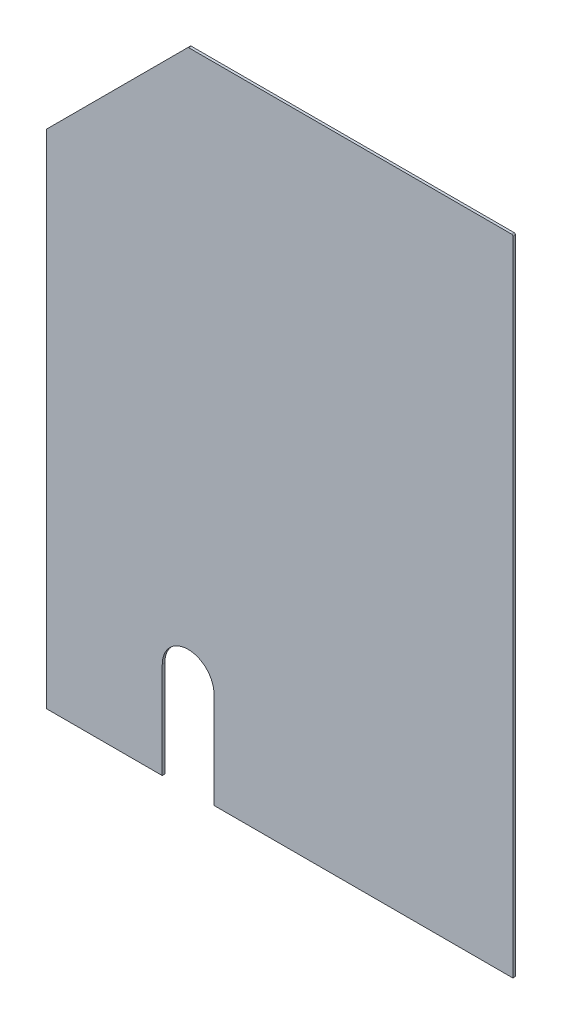
ISO-10303-21;
HEADER;
FILE_DESCRIPTION(('STEP AP214'),'2;1');
FILE_NAME('part.step','',(''),(''),'','','');
FILE_SCHEMA(('AUTOMOTIVE_DESIGN { 1 0 10303 214 1 1 1 1 }'));
ENDSEC;
DATA;
#1=APPLICATION_CONTEXT('core data for automotive mechanical design processes');
#2=APPLICATION_PROTOCOL_DEFINITION('international standard','automotive_design',2000,#1);
#3=PRODUCT_CONTEXT('',#1,'mechanical');
#4=PRODUCT('Part','Part','',(#3));
#5=PRODUCT_RELATED_PRODUCT_CATEGORY('part','',(#4));
#6=PRODUCT_DEFINITION_FORMATION('','',#4);
#7=PRODUCT_DEFINITION_CONTEXT('part definition',#1,'design');
#8=PRODUCT_DEFINITION('design','',#6,#7);
#9=PRODUCT_DEFINITION_SHAPE('','',#8);
#10=(LENGTH_UNIT() NAMED_UNIT(*) SI_UNIT(.MILLI.,.METRE.));
#11=(NAMED_UNIT(*) PLANE_ANGLE_UNIT() SI_UNIT($,.RADIAN.));
#12=(NAMED_UNIT(*) SI_UNIT($,.STERADIAN.) SOLID_ANGLE_UNIT());
#13=UNCERTAINTY_MEASURE_WITH_UNIT(LENGTH_MEASURE(1.E-05),#10,'distance_accuracy_value','');
#14=(GEOMETRIC_REPRESENTATION_CONTEXT(3) GLOBAL_UNCERTAINTY_ASSIGNED_CONTEXT((#13)) GLOBAL_UNIT_ASSIGNED_CONTEXT((#10,
#11,#12)) REPRESENTATION_CONTEXT('',''));
#15=CARTESIAN_POINT('',(0.,0.,0.));
#16=DIRECTION('',(0.,0.,1.));
#17=DIRECTION('',(1.,0.,0.));
#18=AXIS2_PLACEMENT_3D('',#15,#16,#17);
#19=CARTESIAN_POINT('',(-269.326706029105,290.501117880956,-1.5));
#20=DIRECTION('',(0.,0.,1.));
#21=DIRECTION('',(1.,0.,0.));
#22=AXIS2_PLACEMENT_3D('',#19,#20,#21);
#23=CYLINDRICAL_SURFACE('',#22,0.750000000000028);
#24=CARTESIAN_POINT('',(-269.326706029105,290.501117880956,0.));
#25=DIRECTION('',(0.,0.,1.));
#26=DIRECTION('',(1.,0.,0.));
#27=AXIS2_PLACEMENT_3D('',#24,#25,#26);
#28=CIRCLE('',#27,0.750000000000028);
#29=CARTESIAN_POINT('',(-269.857036114995,291.031447966846,0.));
#30=VERTEX_POINT('',#29);
#31=CARTESIAN_POINT('',(-270.076706029105,290.501117880956,0.));
#32=VERTEX_POINT('',#31);
#33=EDGE_CURVE('E159',#30,#32,#28,.T.);
#34=ORIENTED_EDGE('',*,*,#33,.F.);
#35=DIRECTION('',(0.,0.,1.));
#36=VECTOR('',#35,1.);
#37=CARTESIAN_POINT('',(-269.857036114995,291.031447966846,-1.5));
#38=LINE('',#37,#36);
#39=CARTESIAN_POINT('',(-269.857036114995,291.031447966846,-1.5));
#40=VERTEX_POINT('',#39);
#41=EDGE_CURVE('E11',#40,#30,#38,.T.);
#42=ORIENTED_EDGE('',*,*,#41,.F.);
#43=CARTESIAN_POINT('',(-269.326706029105,290.501117880956,-1.5));
#44=DIRECTION('',(0.,0.,1.));
#45=DIRECTION('',(1.,0.,0.));
#46=AXIS2_PLACEMENT_3D('',#43,#44,#45);
#47=CIRCLE('',#46,0.750000000000028);
#48=CARTESIAN_POINT('',(-270.076706029105,290.501117880956,-1.5));
#49=VERTEX_POINT('',#48);
#50=EDGE_CURVE('E191',#40,#49,#47,.T.);
#51=ORIENTED_EDGE('',*,*,#50,.T.);
#52=DIRECTION('',(0.,0.,1.));
#53=VECTOR('',#52,1.);
#54=CARTESIAN_POINT('',(-270.076706029105,290.501117880956,-1.5));
#55=LINE('',#54,#53);
#56=EDGE_CURVE('E41',#49,#32,#55,.T.);
#57=ORIENTED_EDGE('',*,*,#56,.T.);
#58=EDGE_LOOP('',(#34,#42,#51,#57));
#59=FACE_BOUND('',#58,.T.);
#60=ADVANCED_FACE('F38',(#59),#23,.T.);
#61=CARTESIAN_POINT('',(-188.296375943214,372.592108138625,-1.5));
#62=DIRECTION('',(-0.707106781186546,0.707106781186549,0.));
#63=DIRECTION('',(-0.707106781186549,-0.707106781186546,0.));
#64=AXIS2_PLACEMENT_3D('',#61,#62,#63);
#65=PLANE('',#64);
#66=DIRECTION('',(-0.707106781186549,-0.707106781186546,0.));
#67=VECTOR('',#66,1.);
#68=CARTESIAN_POINT('',(-188.296375943214,372.592108138625,0.));
#69=LINE('',#68,#67);
#70=CARTESIAN_POINT('',(-188.296375943214,372.592108138625,0.));
#71=VERTEX_POINT('',#70);
#72=EDGE_CURVE('E189',#71,#30,#69,.T.);
#73=ORIENTED_EDGE('',*,*,#72,.F.);
#74=DIRECTION('',(0.,0.,1.));
#75=VECTOR('',#74,1.);
#76=CARTESIAN_POINT('',(-188.296375943214,372.592108138625,-1.5));
#77=LINE('',#76,#75);
#78=CARTESIAN_POINT('',(-188.296375943214,372.592108138625,-1.5));
#79=VERTEX_POINT('',#78);
#80=EDGE_CURVE('E47',#79,#71,#77,.T.);
#81=ORIENTED_EDGE('',*,*,#80,.F.);
#82=DIRECTION('',(-0.707106781186549,-0.707106781186546,0.));
#83=VECTOR('',#82,1.);
#84=CARTESIAN_POINT('',(-188.296375943214,372.592108138625,-1.5));
#85=LINE('',#84,#83);
#86=EDGE_CURVE('E149',#79,#40,#85,.T.);
#87=ORIENTED_EDGE('',*,*,#86,.T.);
#88=ORIENTED_EDGE('',*,*,#41,.T.);
#89=EDGE_LOOP('',(#73,#81,#87,#88));
#90=FACE_BOUND('',#89,.T.);
#91=ADVANCED_FACE('F211',(#90),#65,.T.);
#92=CARTESIAN_POINT('',(-187.766045857325,372.061778052735,-1.5));
#93=DIRECTION('',(0.,0.,1.));
#94=DIRECTION('',(1.,0.,0.));
#95=AXIS2_PLACEMENT_3D('',#92,#93,#94);
#96=CYLINDRICAL_SURFACE('',#95,0.749999999999962);
#97=CARTESIAN_POINT('',(-187.766045857325,372.061778052735,0.));
#98=DIRECTION('',(0.,0.,1.));
#99=DIRECTION('',(1.,0.,0.));
#100=AXIS2_PLACEMENT_3D('',#97,#98,#99);
#101=CIRCLE('',#100,0.749999999999962);
#102=CARTESIAN_POINT('',(-187.766045857325,372.811778052735,0.));
#103=VERTEX_POINT('',#102);
#104=EDGE_CURVE('E136',#103,#71,#101,.T.);
#105=ORIENTED_EDGE('',*,*,#104,.F.);
#106=DIRECTION('',(0.,0.,1.));
#107=VECTOR('',#106,1.);
#108=CARTESIAN_POINT('',(-187.766045857325,372.811778052735,-1.5));
#109=LINE('',#108,#107);
#110=CARTESIAN_POINT('',(-187.766045857325,372.811778052735,-1.5));
#111=VERTEX_POINT('',#110);
#112=EDGE_CURVE('E131',#111,#103,#109,.T.);
#113=ORIENTED_EDGE('',*,*,#112,.F.);
#114=CARTESIAN_POINT('',(-187.766045857325,372.061778052735,-1.5));
#115=DIRECTION('',(0.,0.,1.));
#116=DIRECTION('',(1.,0.,0.));
#117=AXIS2_PLACEMENT_3D('',#114,#115,#116);
#118=CIRCLE('',#117,0.749999999999962);
#119=EDGE_CURVE('E134',#111,#79,#118,.T.);
#120=ORIENTED_EDGE('',*,*,#119,.T.);
#121=ORIENTED_EDGE('',*,*,#80,.T.);
#122=EDGE_LOOP('',(#105,#113,#120,#121));
#123=FACE_BOUND('',#122,.T.);
#124=ADVANCED_FACE('F133',(#123),#96,.T.);
#125=CARTESIAN_POINT('',(-0.750000000000028,372.811778052735,-1.5));
#126=DIRECTION('',(0.,1.,0.));
#127=DIRECTION('',(0.,0.,1.));
#128=AXIS2_PLACEMENT_3D('',#125,#126,#127);
#129=PLANE('',#128);
#130=DIRECTION('',(-1.,0.,0.));
#131=VECTOR('',#130,1.);
#132=CARTESIAN_POINT('',(-0.750000000000028,372.811778052735,0.));
#133=LINE('',#132,#131);
#134=CARTESIAN_POINT('',(-0.750000000000028,372.811778052735,0.));
#135=VERTEX_POINT('',#134);
#136=EDGE_CURVE('E186',#135,#103,#133,.T.);
#137=ORIENTED_EDGE('',*,*,#136,.F.);
#138=DIRECTION('',(0.,0.,1.));
#139=VECTOR('',#138,1.);
#140=CARTESIAN_POINT('',(-0.750000000000028,372.811778052735,-1.5));
#141=LINE('',#140,#139);
#142=CARTESIAN_POINT('',(-0.750000000000028,372.811778052735,-1.5));
#143=VERTEX_POINT('',#142);
#144=EDGE_CURVE('E141',#143,#135,#141,.T.);
#145=ORIENTED_EDGE('',*,*,#144,.F.);
#146=DIRECTION('',(-1.,0.,0.));
#147=VECTOR('',#146,1.);
#148=CARTESIAN_POINT('',(-0.750000000000028,372.811778052735,-1.5));
#149=LINE('',#148,#147);
#150=EDGE_CURVE('E147',#143,#111,#149,.T.);
#151=ORIENTED_EDGE('',*,*,#150,.T.);
#152=ORIENTED_EDGE('',*,*,#112,.T.);
#153=EDGE_LOOP('',(#137,#145,#151,#152));
#154=FACE_BOUND('',#153,.T.);
#155=ADVANCED_FACE('F151',(#154),#129,.T.);
#156=CARTESIAN_POINT('',(-0.750000000000028,372.061778052735,-1.5));
#157=DIRECTION('',(0.,0.,1.));
#158=DIRECTION('',(1.,0.,0.));
#159=AXIS2_PLACEMENT_3D('',#156,#157,#158);
#160=CYLINDRICAL_SURFACE('',#159,0.749999999999973);
#161=CARTESIAN_POINT('',(-0.750000000000028,372.061778052735,0.));
#162=DIRECTION('',(0.,0.,1.));
#163=DIRECTION('',(1.,0.,0.));
#164=AXIS2_PLACEMENT_3D('',#161,#162,#163);
#165=CIRCLE('',#164,0.749999999999973);
#166=CARTESIAN_POINT('',(0.,372.061778052735,0.));
#167=VERTEX_POINT('',#166);
#168=EDGE_CURVE('E183',#167,#135,#165,.T.);
#169=ORIENTED_EDGE('',*,*,#168,.F.);
#170=DIRECTION('',(0.,0.,1.));
#171=VECTOR('',#170,1.);
#172=CARTESIAN_POINT('',(0.,372.061778052735,-1.5));
#173=LINE('',#172,#171);
#174=CARTESIAN_POINT('',(0.,372.061778052735,-1.5));
#175=VERTEX_POINT('',#174);
#176=EDGE_CURVE('E195',#175,#167,#173,.T.);
#177=ORIENTED_EDGE('',*,*,#176,.F.);
#178=CARTESIAN_POINT('',(-0.750000000000028,372.061778052735,-1.5));
#179=DIRECTION('',(0.,0.,1.));
#180=DIRECTION('',(1.,0.,0.));
#181=AXIS2_PLACEMENT_3D('',#178,#179,#180);
#182=CIRCLE('',#181,0.749999999999973);
#183=EDGE_CURVE('E152',#175,#143,#182,.T.);
#184=ORIENTED_EDGE('',*,*,#183,.T.);
#185=ORIENTED_EDGE('',*,*,#144,.T.);
#186=EDGE_LOOP('',(#169,#177,#184,#185));
#187=FACE_BOUND('',#186,.T.);
#188=ADVANCED_FACE('F224',(#187),#160,.T.);
#189=CARTESIAN_POINT('',(0.,0.,-1.5));
#190=DIRECTION('',(1.,0.,0.));
#191=DIRECTION('',(0.,1.,0.));
#192=AXIS2_PLACEMENT_3D('',#189,#190,#191);
#193=PLANE('',#192);
#194=DIRECTION('',(0.,1.,0.));
#195=VECTOR('',#194,1.);
#196=CARTESIAN_POINT('',(0.,0.,0.));
#197=LINE('',#196,#195);
#198=CARTESIAN_POINT('',(0.,0.,0.));
#199=VERTEX_POINT('',#198);
#200=EDGE_CURVE('E180',#199,#167,#197,.T.);
#201=ORIENTED_EDGE('',*,*,#200,.F.);
#202=DIRECTION('',(0.,0.,1.));
#203=VECTOR('',#202,1.);
#204=CARTESIAN_POINT('',(0.,0.,-1.5));
#205=LINE('',#204,#203);
#206=CARTESIAN_POINT('',(0.,0.,-1.5));
#207=VERTEX_POINT('',#206);
#208=EDGE_CURVE('E197',#207,#199,#205,.T.);
#209=ORIENTED_EDGE('',*,*,#208,.F.);
#210=DIRECTION('',(0.,1.,0.));
#211=VECTOR('',#210,1.);
#212=CARTESIAN_POINT('',(0.,0.,-1.5));
#213=LINE('',#212,#211);
#214=EDGE_CURVE('E154',#207,#175,#213,.T.);
#215=ORIENTED_EDGE('',*,*,#214,.T.);
#216=ORIENTED_EDGE('',*,*,#176,.T.);
#217=EDGE_LOOP('',(#201,#209,#215,#216));
#218=FACE_BOUND('',#217,.T.);
#219=ADVANCED_FACE('F227',(#218),#193,.T.);
#220=CARTESIAN_POINT('',(-173.076706029105,0.,-1.5));
#221=DIRECTION('',(0.,-1.,0.));
#222=DIRECTION('',(1.,0.,0.));
#223=AXIS2_PLACEMENT_3D('',#220,#221,#222);
#224=PLANE('',#223);
#225=DIRECTION('',(1.,0.,0.));
#226=VECTOR('',#225,1.);
#227=CARTESIAN_POINT('',(-173.076706029105,0.,0.));
#228=LINE('',#227,#226);
#229=CARTESIAN_POINT('',(-173.076706029105,0.,0.));
#230=VERTEX_POINT('',#229);
#231=EDGE_CURVE('E177',#230,#199,#228,.T.);
#232=ORIENTED_EDGE('',*,*,#231,.F.);
#233=DIRECTION('',(0.,0.,1.));
#234=VECTOR('',#233,1.);
#235=CARTESIAN_POINT('',(-173.076706029105,0.,-1.5));
#236=LINE('',#235,#234);
#237=CARTESIAN_POINT('',(-173.076706029105,0.,-1.5));
#238=VERTEX_POINT('',#237);
#239=EDGE_CURVE('E199',#238,#230,#236,.T.);
#240=ORIENTED_EDGE('',*,*,#239,.F.);
#241=DIRECTION('',(1.,0.,0.));
#242=VECTOR('',#241,1.);
#243=CARTESIAN_POINT('',(-173.076706029105,0.,-1.5));
#244=LINE('',#243,#242);
#245=EDGE_CURVE('E381',#238,#207,#244,.T.);
#246=ORIENTED_EDGE('',*,*,#245,.T.);
#247=ORIENTED_EDGE('',*,*,#208,.T.);
#248=EDGE_LOOP('',(#232,#240,#246,#247));
#249=FACE_BOUND('',#248,.T.);
#250=ADVANCED_FACE('F231',(#249),#224,.T.);
#251=CARTESIAN_POINT('',(-173.076706029105,55.8117780527354,-1.5));
#252=DIRECTION('',(-1.,0.,0.));
#253=DIRECTION('',(0.,0.,1.));
#254=AXIS2_PLACEMENT_3D('',#251,#252,#253);
#255=PLANE('',#254);
#256=DIRECTION('',(0.,-1.,0.));
#257=VECTOR('',#256,1.);
#258=CARTESIAN_POINT('',(-173.076706029105,55.8117780527354,0.));
#259=LINE('',#258,#257);
#260=CARTESIAN_POINT('',(-173.076706029105,55.8117780527354,0.));
#261=VERTEX_POINT('',#260);
#262=EDGE_CURVE('E174',#261,#230,#259,.T.);
#263=ORIENTED_EDGE('',*,*,#262,.F.);
#264=DIRECTION('',(0.,0.,1.));
#265=VECTOR('',#264,1.);
#266=CARTESIAN_POINT('',(-173.076706029105,55.8117780527354,-1.5));
#267=LINE('',#266,#265);
#268=CARTESIAN_POINT('',(-173.076706029105,55.8117780527354,-1.5));
#269=VERTEX_POINT('',#268);
#270=EDGE_CURVE('E201',#269,#261,#267,.T.);
#271=ORIENTED_EDGE('',*,*,#270,.F.);
#272=DIRECTION('',(0.,-1.,0.));
#273=VECTOR('',#272,1.);
#274=CARTESIAN_POINT('',(-173.076706029105,55.8117780527354,-1.5));
#275=LINE('',#274,#273);
#276=EDGE_CURVE('E385',#269,#238,#275,.T.);
#277=ORIENTED_EDGE('',*,*,#276,.T.);
#278=ORIENTED_EDGE('',*,*,#239,.T.);
#279=EDGE_LOOP('',(#263,#271,#277,#278));
#280=FACE_BOUND('',#279,.T.);
#281=ADVANCED_FACE('F235',(#280),#255,.T.);
#282=CARTESIAN_POINT('',(-188.076706029105,55.8117780527354,-1.5));
#283=DIRECTION('',(0.,0.,1.));
#284=DIRECTION('',(1.,0.,0.));
#285=AXIS2_PLACEMENT_3D('',#282,#283,#284);
#286=CYLINDRICAL_SURFACE('',#285,15.);
#287=CARTESIAN_POINT('',(-188.076706029105,55.8117780527354,0.));
#288=DIRECTION('',(0.,0.,-1.));
#289=DIRECTION('',(1.,0.,0.));
#290=AXIS2_PLACEMENT_3D('',#287,#288,#289);
#291=CIRCLE('',#290,15.);
#292=CARTESIAN_POINT('',(-203.076706029105,55.8117780527354,0.));
#293=VERTEX_POINT('',#292);
#294=EDGE_CURVE('E171',#293,#261,#291,.T.);
#295=ORIENTED_EDGE('',*,*,#294,.F.);
#296=DIRECTION('',(0.,0.,1.));
#297=VECTOR('',#296,1.);
#298=CARTESIAN_POINT('',(-203.076706029105,55.8117780527354,-1.5));
#299=LINE('',#298,#297);
#300=CARTESIAN_POINT('',(-203.076706029105,55.8117780527354,-1.5));
#301=VERTEX_POINT('',#300);
#302=EDGE_CURVE('E203',#301,#293,#299,.T.);
#303=ORIENTED_EDGE('',*,*,#302,.F.);
#304=CARTESIAN_POINT('',(-188.076706029105,55.8117780527354,-1.5));
#305=DIRECTION('',(0.,0.,-1.));
#306=DIRECTION('',(1.,0.,0.));
#307=AXIS2_PLACEMENT_3D('',#304,#305,#306);
#308=CIRCLE('',#307,15.);
#309=EDGE_CURVE('E374',#301,#269,#308,.T.);
#310=ORIENTED_EDGE('',*,*,#309,.T.);
#311=ORIENTED_EDGE('',*,*,#270,.T.);
#312=EDGE_LOOP('',(#295,#303,#310,#311));
#313=FACE_BOUND('',#312,.T.);
#314=ADVANCED_FACE('F239',(#313),#286,.F.);
#315=CARTESIAN_POINT('',(-203.076706029105,55.8117780527354,-1.5));
#316=DIRECTION('',(1.,0.,0.));
#317=DIRECTION('',(0.,0.,-1.));
#318=AXIS2_PLACEMENT_3D('',#315,#316,#317);
#319=PLANE('',#318);
#320=DIRECTION('',(0.,1.,0.));
#321=VECTOR('',#320,1.);
#322=CARTESIAN_POINT('',(-203.076706029105,55.8117780527354,0.));
#323=LINE('',#322,#321);
#324=CARTESIAN_POINT('',(-203.076706029105,0.,0.));
#325=VERTEX_POINT('',#324);
#326=EDGE_CURVE('E168',#325,#293,#323,.T.);
#327=ORIENTED_EDGE('',*,*,#326,.F.);
#328=DIRECTION('',(0.,0.,1.));
#329=VECTOR('',#328,1.);
#330=CARTESIAN_POINT('',(-203.076706029105,0.,-1.5));
#331=LINE('',#330,#329);
#332=CARTESIAN_POINT('',(-203.076706029105,0.,-1.5));
#333=VERTEX_POINT('',#332);
#334=EDGE_CURVE('E205',#333,#325,#331,.T.);
#335=ORIENTED_EDGE('',*,*,#334,.F.);
#336=DIRECTION('',(0.,1.,0.));
#337=VECTOR('',#336,1.);
#338=CARTESIAN_POINT('',(-203.076706029105,55.8117780527354,-1.5));
#339=LINE('',#338,#337);
#340=EDGE_CURVE('E370',#333,#301,#339,.T.);
#341=ORIENTED_EDGE('',*,*,#340,.T.);
#342=ORIENTED_EDGE('',*,*,#302,.T.);
#343=EDGE_LOOP('',(#327,#335,#341,#342));
#344=FACE_BOUND('',#343,.T.);
#345=ADVANCED_FACE('F243',(#344),#319,.T.);
#346=CARTESIAN_POINT('',(-270.076706029105,0.,-1.5));
#347=DIRECTION('',(0.,-1.,0.));
#348=DIRECTION('',(1.,0.,0.));
#349=AXIS2_PLACEMENT_3D('',#346,#347,#348);
#350=PLANE('',#349);
#351=DIRECTION('',(1.,0.,0.));
#352=VECTOR('',#351,1.);
#353=CARTESIAN_POINT('',(-270.076706029105,0.,0.));
#354=LINE('',#353,#352);
#355=CARTESIAN_POINT('',(-270.076706029105,0.,0.));
#356=VERTEX_POINT('',#355);
#357=EDGE_CURVE('E165',#356,#325,#354,.T.);
#358=ORIENTED_EDGE('',*,*,#357,.F.);
#359=DIRECTION('',(0.,0.,1.));
#360=VECTOR('',#359,1.);
#361=CARTESIAN_POINT('',(-270.076706029105,0.,-1.5));
#362=LINE('',#361,#360);
#363=CARTESIAN_POINT('',(-270.076706029105,0.,-1.5));
#364=VERTEX_POINT('',#363);
#365=EDGE_CURVE('E206',#364,#356,#362,.T.);
#366=ORIENTED_EDGE('',*,*,#365,.F.);
#367=DIRECTION('',(1.,0.,0.));
#368=VECTOR('',#367,1.);
#369=CARTESIAN_POINT('',(-270.076706029105,0.,-1.5));
#370=LINE('',#369,#368);
#371=EDGE_CURVE('E391',#364,#333,#370,.T.);
#372=ORIENTED_EDGE('',*,*,#371,.T.);
#373=ORIENTED_EDGE('',*,*,#334,.T.);
#374=EDGE_LOOP('',(#358,#366,#372,#373));
#375=FACE_BOUND('',#374,.T.);
#376=ADVANCED_FACE('F247',(#375),#350,.T.);
#377=CARTESIAN_POINT('',(-270.076706029105,290.501117880956,-1.5));
#378=DIRECTION('',(-1.,0.,0.));
#379=DIRECTION('',(0.,-1.,0.));
#380=AXIS2_PLACEMENT_3D('',#377,#378,#379);
#381=PLANE('',#380);
#382=DIRECTION('',(0.,-1.,0.));
#383=VECTOR('',#382,1.);
#384=CARTESIAN_POINT('',(-270.076706029105,290.501117880956,0.));
#385=LINE('',#384,#383);
#386=EDGE_CURVE('E162',#32,#356,#385,.T.);
#387=ORIENTED_EDGE('',*,*,#386,.F.);
#388=ORIENTED_EDGE('',*,*,#56,.F.);
#389=DIRECTION('',(0.,-1.,0.));
#390=VECTOR('',#389,1.);
#391=CARTESIAN_POINT('',(-270.076706029105,290.501117880956,-1.5));
#392=LINE('',#391,#390);
#393=EDGE_CURVE('E393',#49,#364,#392,.T.);
#394=ORIENTED_EDGE('',*,*,#393,.T.);
#395=ORIENTED_EDGE('',*,*,#365,.T.);
#396=EDGE_LOOP('',(#387,#388,#394,#395));
#397=FACE_BOUND('',#396,.T.);
#398=ADVANCED_FACE('F208',(#397),#381,.T.);
#399=CARTESIAN_POINT('',(-269.326706029105,290.501117880956,-1.5));
#400=DIRECTION('',(0.,0.,1.));
#401=DIRECTION('',(1.,0.,0.));
#402=AXIS2_PLACEMENT_3D('',#399,#400,#401);
#403=PLANE('',#402);
#404=ORIENTED_EDGE('',*,*,#50,.F.);
#405=ORIENTED_EDGE('',*,*,#86,.F.);
#406=ORIENTED_EDGE('',*,*,#119,.F.);
#407=ORIENTED_EDGE('',*,*,#150,.F.);
#408=ORIENTED_EDGE('',*,*,#183,.F.);
#409=ORIENTED_EDGE('',*,*,#214,.F.);
#410=ORIENTED_EDGE('',*,*,#245,.F.);
#411=ORIENTED_EDGE('',*,*,#276,.F.);
#412=ORIENTED_EDGE('',*,*,#309,.F.);
#413=ORIENTED_EDGE('',*,*,#340,.F.);
#414=ORIENTED_EDGE('',*,*,#371,.F.);
#415=ORIENTED_EDGE('',*,*,#393,.F.);
#416=EDGE_LOOP('',(#404,#405,#406,#407,#408,#409,#410,#411,#412,#413,#414,#415));
#417=FACE_BOUND('',#416,.T.);
#418=ADVANCED_FACE('F145',(#417),#403,.F.);
#419=CARTESIAN_POINT('',(-269.326706029105,290.501117880956,0.));
#420=DIRECTION('',(0.,0.,1.));
#421=DIRECTION('',(1.,0.,0.));
#422=AXIS2_PLACEMENT_3D('',#419,#420,#421);
#423=PLANE('',#422);
#424=ORIENTED_EDGE('',*,*,#33,.T.);
#425=ORIENTED_EDGE('',*,*,#386,.T.);
#426=ORIENTED_EDGE('',*,*,#357,.T.);
#427=ORIENTED_EDGE('',*,*,#326,.T.);
#428=ORIENTED_EDGE('',*,*,#294,.T.);
#429=ORIENTED_EDGE('',*,*,#262,.T.);
#430=ORIENTED_EDGE('',*,*,#231,.T.);
#431=ORIENTED_EDGE('',*,*,#200,.T.);
#432=ORIENTED_EDGE('',*,*,#168,.T.);
#433=ORIENTED_EDGE('',*,*,#136,.T.);
#434=ORIENTED_EDGE('',*,*,#104,.T.);
#435=ORIENTED_EDGE('',*,*,#72,.T.);
#436=EDGE_LOOP('',(#424,#425,#426,#427,#428,#429,#430,#431,#432,#433,#434,#435));
#437=FACE_BOUND('',#436,.T.);
#438=ADVANCED_FACE('F210',(#437),#423,.T.);
#439=CLOSED_SHELL('',(#60,#91,#124,#155,#188,#219,#250,#281,#314,#345,#376,#398,#418,#438));
#440=MANIFOLD_SOLID_BREP('B2',#439);
#441=ADVANCED_BREP_SHAPE_REPRESENTATION('',(#18,#440),#14);
#442=SHAPE_DEFINITION_REPRESENTATION(#9,#441);
ENDSEC;
END-ISO-10303-21;
